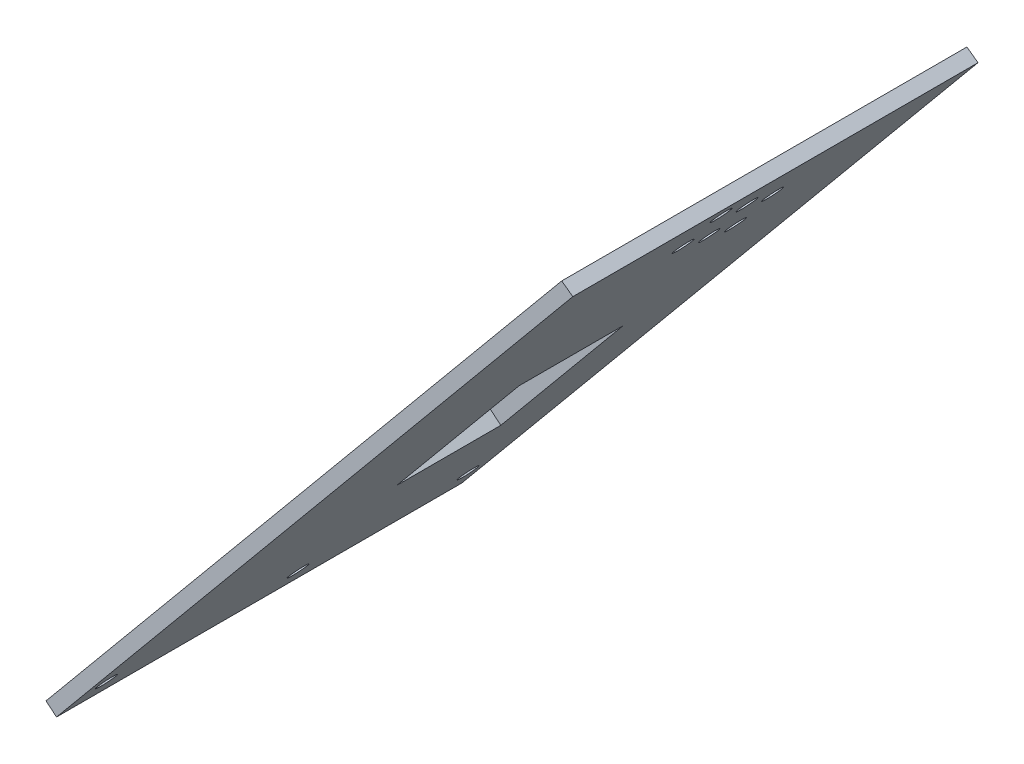
ISO-10303-21;
HEADER;
FILE_DESCRIPTION(('STEP AP214'),'2;1');
FILE_NAME('part.step','',(''),(''),'','','');
FILE_SCHEMA(('AUTOMOTIVE_DESIGN { 1 0 10303 214 1 1 1 1 }'));
ENDSEC;
DATA;
#1=APPLICATION_CONTEXT('core data for automotive mechanical design processes');
#2=APPLICATION_PROTOCOL_DEFINITION('international standard','automotive_design',2000,#1);
#3=PRODUCT_CONTEXT('',#1,'mechanical');
#4=PRODUCT('Part','Part','',(#3));
#5=PRODUCT_RELATED_PRODUCT_CATEGORY('part','',(#4));
#6=PRODUCT_DEFINITION_FORMATION('','',#4);
#7=PRODUCT_DEFINITION_CONTEXT('part definition',#1,'design');
#8=PRODUCT_DEFINITION('design','',#6,#7);
#9=PRODUCT_DEFINITION_SHAPE('','',#8);
#10=(LENGTH_UNIT() NAMED_UNIT(*) SI_UNIT(.MILLI.,.METRE.));
#11=(NAMED_UNIT(*) PLANE_ANGLE_UNIT() SI_UNIT($,.RADIAN.));
#12=(NAMED_UNIT(*) SI_UNIT($,.STERADIAN.) SOLID_ANGLE_UNIT());
#13=UNCERTAINTY_MEASURE_WITH_UNIT(LENGTH_MEASURE(1.E-05),#10,'distance_accuracy_value','');
#14=(GEOMETRIC_REPRESENTATION_CONTEXT(3) GLOBAL_UNCERTAINTY_ASSIGNED_CONTEXT((#13)) GLOBAL_UNIT_ASSIGNED_CONTEXT((#10,
#11,#12)) REPRESENTATION_CONTEXT('',''));
#15=CARTESIAN_POINT('',(0.,0.,0.));
#16=DIRECTION('',(0.,0.,1.));
#17=DIRECTION('',(1.,0.,0.));
#18=AXIS2_PLACEMENT_3D('',#15,#16,#17);
#19=CARTESIAN_POINT('',(1.92394482496182,-1.59638225701197,-37.));
#20=DIRECTION('',(0.76957792998473,-0.638552902804786,0.));
#21=DIRECTION('',(0.638552902804786,0.76957792998473,0.));
#22=AXIS2_PLACEMENT_3D('',#19,#20,#21);
#23=PLANE('',#22);
#24=CARTESIAN_POINT('',(5.43598579038817,2.63629635790407,33.0000000000001));
#25=DIRECTION('',(0.76957792998473,-0.638552902804786,0.));
#26=DIRECTION('',(0.638552902804786,0.76957792998473,0.));
#27=AXIS2_PLACEMENT_3D('',#24,#25,#26);
#28=CIRCLE('',#27,1.69999999999999);
#29=CARTESIAN_POINT('',(6.5215257251563,3.9445788388781,33.0000000000001));
#30=VERTEX_POINT('',#29);
#31=EDGE_CURVE('E197',#30,#30,#28,.T.);
#32=ORIENTED_EDGE('',*,*,#31,.F.);
#33=EDGE_LOOP('',(#32));
#34=FACE_BOUND('',#33,.T.);
#35=CARTESIAN_POINT('',(5.43598579038815,2.63629635790404,-32.9999999999999));
#36=DIRECTION('',(0.76957792998473,-0.638552902804786,0.));
#37=DIRECTION('',(0.638552902804786,0.76957792998473,0.));
#38=AXIS2_PLACEMENT_3D('',#35,#36,#37);
#39=CIRCLE('',#38,1.69999999999999);
#40=CARTESIAN_POINT('',(6.52152572515628,3.94457883887808,-32.9999999999999));
#41=VERTEX_POINT('',#40);
#42=EDGE_CURVE('E200',#41,#41,#39,.T.);
#43=ORIENTED_EDGE('',*,*,#42,.F.);
#44=EDGE_LOOP('',(#43));
#45=FACE_BOUND('',#44,.T.);
#46=CARTESIAN_POINT('',(5.43598579038817,2.63629635790407,-1.99999999999988));
#47=DIRECTION('',(0.76957792998473,-0.638552902804786,0.));
#48=DIRECTION('',(0.638552902804786,0.76957792998473,0.));
#49=AXIS2_PLACEMENT_3D('',#46,#47,#48);
#50=CIRCLE('',#49,1.7);
#51=CARTESIAN_POINT('',(6.5215257251563,3.9445788388781,-1.99999999999988));
#52=VERTEX_POINT('',#51);
#53=EDGE_CURVE('E203',#52,#52,#50,.T.);
#54=ORIENTED_EDGE('',*,*,#53,.F.);
#55=EDGE_LOOP('',(#54));
#56=FACE_BOUND('',#55,.T.);
#57=DIRECTION('',(0.638552902804786,0.76957792998473,0.));
#58=VECTOR('',#57,1.);
#59=CARTESIAN_POINT('',(1.92394482496182,-1.59638225701197,-17.));
#60=LINE('',#59,#58);
#61=CARTESIAN_POINT('',(27.4660609371533,29.1867349423772,-17.));
#62=VERTEX_POINT('',#61);
#63=CARTESIAN_POINT('',(49.8154125353208,56.1219624918428,-17.));
#64=VERTEX_POINT('',#63);
#65=EDGE_CURVE('E171',#62,#64,#60,.T.);
#66=ORIENTED_EDGE('',*,*,#65,.F.);
#67=DIRECTION('',(0.,0.,-1.));
#68=VECTOR('',#67,1.);
#69=CARTESIAN_POINT('',(27.4660609371533,29.1867349423772,-37.));
#70=LINE('',#69,#68);
#71=CARTESIAN_POINT('',(27.4660609371533,29.1867349423772,1.99999999999999));
#72=VERTEX_POINT('',#71);
#73=EDGE_CURVE('E177',#72,#62,#70,.T.);
#74=ORIENTED_EDGE('',*,*,#73,.F.);
#75=DIRECTION('',(-0.638552902804786,-0.76957792998473,0.));
#76=VECTOR('',#75,1.);
#77=CARTESIAN_POINT('',(1.92394482496182,-1.59638225701197,1.99999999999999));
#78=LINE('',#77,#76);
#79=CARTESIAN_POINT('',(49.8154125353208,56.1219624918428,1.99999999999999));
#80=VERTEX_POINT('',#79);
#81=EDGE_CURVE('E175',#80,#72,#78,.T.);
#82=ORIENTED_EDGE('',*,*,#81,.F.);
#83=DIRECTION('',(0.,0.,1.));
#84=VECTOR('',#83,1.);
#85=CARTESIAN_POINT('',(49.8154125353208,56.1219624918428,-37.));
#86=LINE('',#85,#84);
#87=EDGE_CURVE('E173',#64,#80,#86,.T.);
#88=ORIENTED_EDGE('',*,*,#87,.F.);
#89=EDGE_LOOP('',(#66,#74,#82,#88));
#90=FACE_BOUND('',#89,.T.);
#91=CARTESIAN_POINT('',(80.9949650068493,93.6992647693719,-1.5533866649602));
#92=DIRECTION('',(0.76957792998473,-0.638552902804786,0.));
#93=DIRECTION('',(0.638552902804786,0.76957792998473,0.));
#94=AXIS2_PLACEMENT_3D('',#91,#92,#93);
#95=CIRCLE('',#94,1.70000000000001);
#96=CARTESIAN_POINT('',(82.0805049416174,95.007547250346,-1.5533866649602));
#97=VERTEX_POINT('',#96);
#98=EDGE_CURVE('E163',#97,#97,#95,.T.);
#99=ORIENTED_EDGE('',*,*,#98,.F.);
#100=EDGE_LOOP('',(#99));
#101=FACE_BOUND('',#100,.T.);
#102=CARTESIAN_POINT('',(84.6494465443313,98.1036114169708,-9.4570049175146));
#103=DIRECTION('',(0.76957792998473,-0.638552902804786,0.));
#104=DIRECTION('',(0.638552902804786,0.76957792998473,0.));
#105=AXIS2_PLACEMENT_3D('',#102,#103,#104);
#106=CIRCLE('',#105,1.7);
#107=CARTESIAN_POINT('',(85.7349864790994,99.4118938979449,-9.4570049175146));
#108=VERTEX_POINT('',#107);
#109=EDGE_CURVE('E160',#108,#108,#106,.T.);
#110=ORIENTED_EDGE('',*,*,#109,.F.);
#111=EDGE_LOOP('',(#110));
#112=FACE_BOUND('',#111,.T.);
#113=CARTESIAN_POINT('',(87.9437084100887,102.073824716983,-1.45229617633338));
#114=DIRECTION('',(0.76957792998473,-0.638552902804786,0.));
#115=DIRECTION('',(0.638552902804786,0.76957792998473,0.));
#116=AXIS2_PLACEMENT_3D('',#113,#114,#115);
#117=CIRCLE('',#116,1.7);
#118=CARTESIAN_POINT('',(89.0292483448568,103.382107197957,-1.45229617633338));
#119=VERTEX_POINT('',#118);
#120=EDGE_CURVE('E157',#119,#119,#117,.T.);
#121=ORIENTED_EDGE('',*,*,#120,.F.);
#122=EDGE_LOOP('',(#121));
#123=FACE_BOUND('',#122,.T.);
#124=CARTESIAN_POINT('',(84.3308297053064,97.7196174105886,6.55241256484784));
#125=DIRECTION('',(0.76957792998473,-0.638552902804786,0.));
#126=DIRECTION('',(0.638552902804786,0.76957792998473,0.));
#127=AXIS2_PLACEMENT_3D('',#124,#125,#126);
#128=CIRCLE('',#127,1.7);
#129=CARTESIAN_POINT('',(85.4163696400746,99.0278998915626,6.55241256484784));
#130=VERTEX_POINT('',#129);
#131=EDGE_CURVE('E156',#130,#130,#128,.T.);
#132=ORIENTED_EDGE('',*,*,#131,.F.);
#133=EDGE_LOOP('',(#132));
#134=FACE_BOUND('',#133,.T.);
#135=CARTESIAN_POINT('',(77.6591003083921,89.6789121281552,-9.65918589476824));
#136=DIRECTION('',(0.76957792998473,-0.638552902804786,0.));
#137=DIRECTION('',(0.638552902804786,0.76957792998473,0.));
#138=AXIS2_PLACEMENT_3D('',#135,#136,#137);
#139=CIRCLE('',#138,1.70000000000001);
#140=CARTESIAN_POINT('',(78.7446402431603,90.9871946091293,-9.65918589476824));
#141=VERTEX_POINT('',#140);
#142=EDGE_CURVE('E166',#141,#141,#139,.T.);
#143=ORIENTED_EDGE('',*,*,#142,.F.);
#144=EDGE_LOOP('',(#143));
#145=FACE_BOUND('',#144,.T.);
#146=CARTESIAN_POINT('',(91.2379702822316,106.044038024692,6.55241256484785));
#147=DIRECTION('',(0.76957792998473,-0.638552902804786,0.));
#148=DIRECTION('',(0.638552902804786,0.76957792998473,0.));
#149=AXIS2_PLACEMENT_3D('',#146,#147,#148);
#150=CIRCLE('',#149,1.70000000000001);
#151=CARTESIAN_POINT('',(92.3235102169998,107.352320505666,6.55241256484785));
#152=VERTEX_POINT('',#151);
#153=EDGE_CURVE('E137',#152,#152,#150,.T.);
#154=ORIENTED_EDGE('',*,*,#153,.F.);
#155=EDGE_LOOP('',(#154));
#156=FACE_BOUND('',#155,.T.);
#157=DIRECTION('',(0.,0.,1.));
#158=VECTOR('',#157,1.);
#159=CARTESIAN_POINT('',(94.6138037577798,110.11256065872,-37.));
#160=LINE('',#159,#158);
#161=CARTESIAN_POINT('',(94.6138037577798,110.11256065872,-37.));
#162=VERTEX_POINT('',#161);
#163=CARTESIAN_POINT('',(94.6138037577798,110.11256065872,37.));
#164=VERTEX_POINT('',#163);
#165=EDGE_CURVE('E11',#162,#164,#160,.T.);
#166=ORIENTED_EDGE('',*,*,#165,.T.);
#167=DIRECTION('',(0.638552902804786,0.76957792998473,0.));
#168=VECTOR('',#167,1.);
#169=CARTESIAN_POINT('',(1.92394482496182,-1.59638225701197,37.));
#170=LINE('',#169,#168);
#171=CARTESIAN_POINT('',(0.327562567949858,-3.52032708197379,37.));
#172=VERTEX_POINT('',#171);
#173=EDGE_CURVE('E114',#172,#164,#170,.T.);
#174=ORIENTED_EDGE('',*,*,#173,.F.);
#175=DIRECTION('',(0.,0.,1.));
#176=VECTOR('',#175,1.);
#177=CARTESIAN_POINT('',(0.327562567949858,-3.52032708197379,-37.));
#178=LINE('',#177,#176);
#179=CARTESIAN_POINT('',(0.327562567949858,-3.52032708197379,-37.));
#180=VERTEX_POINT('',#179);
#181=EDGE_CURVE('E45',#180,#172,#178,.T.);
#182=ORIENTED_EDGE('',*,*,#181,.F.);
#183=DIRECTION('',(0.638552902804786,0.76957792998473,0.));
#184=VECTOR('',#183,1.);
#185=CARTESIAN_POINT('',(1.92394482496182,-1.59638225701197,-37.));
#186=LINE('',#185,#184);
#187=EDGE_CURVE('E116',#180,#162,#186,.T.);
#188=ORIENTED_EDGE('',*,*,#187,.T.);
#189=EDGE_LOOP('',(#166,#174,#182,#188));
#190=FACE_BOUND('',#189,.T.);
#191=ADVANCED_FACE('F36',(#34,#45,#56,#90,#101,#112,#123,#134,#145,#156,#190),#23,.T.);
#192=CARTESIAN_POINT('',(-16.2183629267218,10.2085603283291,-37.));
#193=DIRECTION('',(-0.638552902804786,-0.76957792998473,0.));
#194=DIRECTION('',(0.76957792998473,-0.638552902804786,0.));
#195=AXIS2_PLACEMENT_3D('',#192,#193,#194);
#196=PLANE('',#195);
#197=DIRECTION('',(0.,0.,1.));
#198=VECTOR('',#197,1.);
#199=CARTESIAN_POINT('',(-1.59638225701197,-1.92394482496182,-37.));
#200=LINE('',#199,#198);
#201=CARTESIAN_POINT('',(-1.59638225701196,-1.92394482496182,-37.));
#202=VERTEX_POINT('',#201);
#203=CARTESIAN_POINT('',(-1.59638225701196,-1.92394482496182,37.));
#204=VERTEX_POINT('',#203);
#205=EDGE_CURVE('E211',#202,#204,#200,.T.);
#206=ORIENTED_EDGE('',*,*,#205,.F.);
#207=DIRECTION('',(0.76957792998473,-0.638552902804786,0.));
#208=VECTOR('',#207,1.);
#209=CARTESIAN_POINT('',(-16.2183629267218,10.2085603283291,-37.));
#210=LINE('',#209,#208);
#211=EDGE_CURVE('E124',#202,#180,#210,.T.);
#212=ORIENTED_EDGE('',*,*,#211,.T.);
#213=ORIENTED_EDGE('',*,*,#181,.T.);
#214=DIRECTION('',(0.76957792998473,-0.638552902804786,0.));
#215=VECTOR('',#214,1.);
#216=CARTESIAN_POINT('',(-16.2183629267218,10.2085603283291,37.));
#217=LINE('',#216,#215);
#218=EDGE_CURVE('E119',#204,#172,#217,.T.);
#219=ORIENTED_EDGE('',*,*,#218,.F.);
#220=EDGE_LOOP('',(#206,#212,#213,#219));
#221=FACE_BOUND('',#220,.T.);
#222=ADVANCED_FACE('F222',(#221),#196,.T.);
#223=CARTESIAN_POINT('',(0.,0.,-37.));
#224=DIRECTION('',(0.76957792998473,-0.638552902804786,0.));
#225=DIRECTION('',(0.638552902804786,0.76957792998473,0.));
#226=AXIS2_PLACEMENT_3D('',#223,#224,#225);
#227=PLANE('',#226);
#228=CARTESIAN_POINT('',(3.51204096542634,4.23267861491604,33.0000000000001));
#229=DIRECTION('',(-0.76957792998473,0.638552902804786,0.));
#230=DIRECTION('',(-0.638552902804786,-0.76957792998473,0.));
#231=AXIS2_PLACEMENT_3D('',#228,#229,#230);
#232=CIRCLE('',#231,1.69999999999999);
#233=CARTESIAN_POINT('',(2.42650103065821,2.924396133942,33.0000000000001));
#234=VERTEX_POINT('',#233);
#235=EDGE_CURVE('E206',#234,#234,#232,.T.);
#236=ORIENTED_EDGE('',*,*,#235,.F.);
#237=EDGE_LOOP('',(#236));
#238=FACE_BOUND('',#237,.T.);
#239=CARTESIAN_POINT('',(3.51204096542632,4.23267861491601,-32.9999999999999));
#240=DIRECTION('',(-0.76957792998473,0.638552902804786,0.));
#241=DIRECTION('',(-0.638552902804786,-0.76957792998473,0.));
#242=AXIS2_PLACEMENT_3D('',#239,#240,#241);
#243=CIRCLE('',#242,1.69999999999999);
#244=CARTESIAN_POINT('',(2.42650103065819,2.92439613394198,-32.9999999999999));
#245=VERTEX_POINT('',#244);
#246=EDGE_CURVE('E210',#245,#245,#243,.T.);
#247=ORIENTED_EDGE('',*,*,#246,.F.);
#248=EDGE_LOOP('',(#247));
#249=FACE_BOUND('',#248,.T.);
#250=CARTESIAN_POINT('',(3.51204096542634,4.23267861491603,-1.99999999999988));
#251=DIRECTION('',(-0.76957792998473,0.638552902804786,0.));
#252=DIRECTION('',(-0.638552902804786,-0.76957792998473,0.));
#253=AXIS2_PLACEMENT_3D('',#250,#251,#252);
#254=CIRCLE('',#253,1.7);
#255=CARTESIAN_POINT('',(2.42650103065821,2.924396133942,-1.99999999999988));
#256=VERTEX_POINT('',#255);
#257=EDGE_CURVE('E207',#256,#256,#254,.T.);
#258=ORIENTED_EDGE('',*,*,#257,.F.);
#259=EDGE_LOOP('',(#258));
#260=FACE_BOUND('',#259,.T.);
#261=DIRECTION('',(0.,0.,1.));
#262=VECTOR('',#261,1.);
#263=CARTESIAN_POINT('',(25.5421161121915,30.7831171993892,-17.));
#264=LINE('',#263,#262);
#265=CARTESIAN_POINT('',(25.5421161121914,30.7831171993892,-17.));
#266=VERTEX_POINT('',#265);
#267=CARTESIAN_POINT('',(25.5421161121915,30.7831171993892,1.99999999999999));
#268=VERTEX_POINT('',#267);
#269=EDGE_CURVE('E193',#266,#268,#264,.T.);
#270=ORIENTED_EDGE('',*,*,#269,.F.);
#271=DIRECTION('',(-0.638552902804786,-0.769577929984729,0.));
#272=VECTOR('',#271,1.);
#273=CARTESIAN_POINT('',(25.5421161121915,30.7831171993892,-17.));
#274=LINE('',#273,#272);
#275=CARTESIAN_POINT('',(47.891467710359,57.7183447488547,-17.));
#276=VERTEX_POINT('',#275);
#277=EDGE_CURVE('E195',#276,#266,#274,.T.);
#278=ORIENTED_EDGE('',*,*,#277,.F.);
#279=DIRECTION('',(0.,0.,-1.));
#280=VECTOR('',#279,1.);
#281=CARTESIAN_POINT('',(47.891467710359,57.7183447488547,-17.));
#282=LINE('',#281,#280);
#283=CARTESIAN_POINT('',(47.891467710359,57.7183447488547,1.99999999999999));
#284=VERTEX_POINT('',#283);
#285=EDGE_CURVE('E183',#284,#276,#282,.T.);
#286=ORIENTED_EDGE('',*,*,#285,.F.);
#287=DIRECTION('',(0.638552902804786,0.769577929984729,0.));
#288=VECTOR('',#287,1.);
#289=CARTESIAN_POINT('',(25.5421161121915,30.7831171993892,1.99999999999999));
#290=LINE('',#289,#288);
#291=EDGE_CURVE('E190',#268,#284,#290,.T.);
#292=ORIENTED_EDGE('',*,*,#291,.F.);
#293=EDGE_LOOP('',(#270,#278,#286,#292));
#294=FACE_BOUND('',#293,.T.);
#295=CARTESIAN_POINT('',(79.0710201818875,95.2956470263839,-1.5533866649602));
#296=DIRECTION('',(0.76957792998473,-0.638552902804786,0.));
#297=DIRECTION('',(0.638552902804786,0.76957792998473,0.));
#298=AXIS2_PLACEMENT_3D('',#295,#296,#297);
#299=CIRCLE('',#298,1.70000000000001);
#300=CARTESIAN_POINT('',(80.1565601166556,96.6039295073579,-1.5533866649602));
#301=VERTEX_POINT('',#300);
#302=EDGE_CURVE('E40',#301,#301,#299,.T.);
#303=ORIENTED_EDGE('',*,*,#302,.T.);
#304=EDGE_LOOP('',(#303));
#305=FACE_BOUND('',#304,.T.);
#306=CARTESIAN_POINT('',(82.7255017193695,99.6999936739828,-9.4570049175146));
#307=DIRECTION('',(0.76957792998473,-0.638552902804786,0.));
#308=DIRECTION('',(0.638552902804786,0.76957792998473,0.));
#309=AXIS2_PLACEMENT_3D('',#306,#307,#308);
#310=CIRCLE('',#309,1.7);
#311=CARTESIAN_POINT('',(83.8110416541376,101.008276154957,-9.4570049175146));
#312=VERTEX_POINT('',#311);
#313=EDGE_CURVE('E145',#312,#312,#310,.T.);
#314=ORIENTED_EDGE('',*,*,#313,.T.);
#315=EDGE_LOOP('',(#314));
#316=FACE_BOUND('',#315,.T.);
#317=CARTESIAN_POINT('',(86.0197635851269,103.670206973995,-1.45229617633338));
#318=DIRECTION('',(0.76957792998473,-0.638552902804786,0.));
#319=DIRECTION('',(0.638552902804786,0.76957792998473,0.));
#320=AXIS2_PLACEMENT_3D('',#317,#318,#319);
#321=CIRCLE('',#320,1.7);
#322=CARTESIAN_POINT('',(87.105303519895,104.978489454969,-1.45229617633338));
#323=VERTEX_POINT('',#322);
#324=EDGE_CURVE('E143',#323,#323,#321,.T.);
#325=ORIENTED_EDGE('',*,*,#324,.T.);
#326=EDGE_LOOP('',(#325));
#327=FACE_BOUND('',#326,.T.);
#328=CARTESIAN_POINT('',(82.4068848803446,99.3159996676006,6.55241256484784));
#329=DIRECTION('',(0.76957792998473,-0.638552902804786,0.));
#330=DIRECTION('',(0.638552902804786,0.76957792998473,0.));
#331=AXIS2_PLACEMENT_3D('',#328,#329,#330);
#332=CIRCLE('',#331,1.7);
#333=CARTESIAN_POINT('',(83.4924248151127,100.624282148575,6.55241256484784));
#334=VERTEX_POINT('',#333);
#335=EDGE_CURVE('E140',#334,#334,#332,.T.);
#336=ORIENTED_EDGE('',*,*,#335,.T.);
#337=EDGE_LOOP('',(#336));
#338=FACE_BOUND('',#337,.T.);
#339=CARTESIAN_POINT('',(75.7351554834303,91.2752943851672,-9.65918589476824));
#340=DIRECTION('',(0.76957792998473,-0.638552902804786,0.));
#341=DIRECTION('',(0.638552902804786,0.76957792998473,0.));
#342=AXIS2_PLACEMENT_3D('',#339,#340,#341);
#343=CIRCLE('',#342,1.70000000000001);
#344=CARTESIAN_POINT('',(76.8206954181984,92.5835768661413,-9.65918589476824));
#345=VERTEX_POINT('',#344);
#346=EDGE_CURVE('E136',#345,#345,#343,.T.);
#347=ORIENTED_EDGE('',*,*,#346,.T.);
#348=EDGE_LOOP('',(#347));
#349=FACE_BOUND('',#348,.T.);
#350=CARTESIAN_POINT('',(89.3140254572698,107.640420281704,6.55241256484785));
#351=DIRECTION('',(0.76957792998473,-0.638552902804786,0.));
#352=DIRECTION('',(0.638552902804786,0.76957792998473,0.));
#353=AXIS2_PLACEMENT_3D('',#350,#351,#352);
#354=CIRCLE('',#353,1.70000000000001);
#355=CARTESIAN_POINT('',(90.3995653920379,108.948702762678,6.55241256484785));
#356=VERTEX_POINT('',#355);
#357=EDGE_CURVE('E133',#356,#356,#354,.T.);
#358=ORIENTED_EDGE('',*,*,#357,.T.);
#359=EDGE_LOOP('',(#358));
#360=FACE_BOUND('',#359,.T.);
#361=DIRECTION('',(0.638552902804786,0.76957792998473,0.));
#362=VECTOR('',#361,1.);
#363=CARTESIAN_POINT('',(0.,0.,-37.));
#364=LINE('',#363,#362);
#365=CARTESIAN_POINT('',(92.590170906694,111.588799847786,-37.));
#366=VERTEX_POINT('',#365);
#367=EDGE_CURVE('E121',#202,#366,#364,.T.);
#368=ORIENTED_EDGE('',*,*,#367,.F.);
#369=ORIENTED_EDGE('',*,*,#205,.T.);
#370=DIRECTION('',(0.638552902804786,0.76957792998473,0.));
#371=VECTOR('',#370,1.);
#372=CARTESIAN_POINT('',(0.,0.,37.));
#373=LINE('',#372,#371);
#374=CARTESIAN_POINT('',(92.590170906694,111.588799847786,37.));
#375=VERTEX_POINT('',#374);
#376=EDGE_CURVE('E53',#204,#375,#373,.T.);
#377=ORIENTED_EDGE('',*,*,#376,.T.);
#378=DIRECTION('',(0.,0.,1.));
#379=VECTOR('',#378,1.);
#380=CARTESIAN_POINT('',(92.590170906694,111.588799847786,-37.));
#381=LINE('',#380,#379);
#382=EDGE_CURVE('E106',#366,#375,#381,.T.);
#383=ORIENTED_EDGE('',*,*,#382,.F.);
#384=EDGE_LOOP('',(#368,#369,#377,#383));
#385=FACE_BOUND('',#384,.T.);
#386=ADVANCED_FACE('F38',(#238,#249,#260,#294,#305,#316,#327,#338,#349,#360,#385),#227,.F.);
#387=CARTESIAN_POINT('',(116.785428362884,96.0577713406346,-37.));
#388=DIRECTION('',(0.,0.,1.));
#389=DIRECTION('',(1.,0.,0.));
#390=AXIS2_PLACEMENT_3D('',#387,#388,#389);
#391=PLANE('',#390);
#392=ORIENTED_EDGE('',*,*,#211,.F.);
#393=ORIENTED_EDGE('',*,*,#367,.T.);
#394=DIRECTION('',(0.807879498093236,-0.589347704297405,0.));
#395=VECTOR('',#394,1.);
#396=CARTESIAN_POINT('',(94.6138037577798,110.11256065872,-37.));
#397=LINE('',#396,#395);
#398=EDGE_CURVE('E108',#366,#162,#397,.T.);
#399=ORIENTED_EDGE('',*,*,#398,.T.);
#400=ORIENTED_EDGE('',*,*,#187,.F.);
#401=EDGE_LOOP('',(#392,#393,#399,#400));
#402=FACE_BOUND('',#401,.T.);
#403=ADVANCED_FACE('F219',(#402),#391,.F.);
#404=CARTESIAN_POINT('',(116.785428362884,96.0577713406346,37.));
#405=DIRECTION('',(0.,0.,1.));
#406=DIRECTION('',(1.,0.,0.));
#407=AXIS2_PLACEMENT_3D('',#404,#405,#406);
#408=PLANE('',#407);
#409=ORIENTED_EDGE('',*,*,#376,.F.);
#410=ORIENTED_EDGE('',*,*,#218,.T.);
#411=ORIENTED_EDGE('',*,*,#173,.T.);
#412=DIRECTION('',(0.807879498093236,-0.589347704297405,0.));
#413=VECTOR('',#412,1.);
#414=CARTESIAN_POINT('',(94.6138037577798,110.11256065872,37.));
#415=LINE('',#414,#413);
#416=EDGE_CURVE('E102',#375,#164,#415,.T.);
#417=ORIENTED_EDGE('',*,*,#416,.F.);
#418=EDGE_LOOP('',(#409,#410,#411,#417));
#419=FACE_BOUND('',#418,.T.);
#420=ADVANCED_FACE('F117',(#419),#408,.T.);
#421=CARTESIAN_POINT('',(73.5376778925828,120.730754789202,6.55241256484785));
#422=DIRECTION('',(0.769577929984729,-0.638552902804786,0.));
#423=DIRECTION('',(0.638552902804786,0.76957792998473,0.));
#424=AXIS2_PLACEMENT_3D('',#421,#422,#423);
#425=CYLINDRICAL_SURFACE('',#424,1.70000000000001);
#426=ORIENTED_EDGE('',*,*,#153,.T.);
#427=EDGE_LOOP('',(#426));
#428=FACE_BOUND('',#427,.T.);
#429=ORIENTED_EDGE('',*,*,#357,.F.);
#430=EDGE_LOOP('',(#429));
#431=FACE_BOUND('',#430,.T.);
#432=ADVANCED_FACE('F242',(#428,#431),#425,.F.);
#433=CARTESIAN_POINT('',(59.9588079187434,104.365628892665,-9.65918589476824));
#434=DIRECTION('',(0.769577929984729,-0.638552902804786,0.));
#435=DIRECTION('',(0.638552902804786,0.76957792998473,0.));
#436=AXIS2_PLACEMENT_3D('',#433,#434,#435);
#437=CYLINDRICAL_SURFACE('',#436,1.70000000000001);
#438=ORIENTED_EDGE('',*,*,#142,.T.);
#439=EDGE_LOOP('',(#438));
#440=FACE_BOUND('',#439,.T.);
#441=ORIENTED_EDGE('',*,*,#346,.F.);
#442=EDGE_LOOP('',(#441));
#443=FACE_BOUND('',#442,.T.);
#444=ADVANCED_FACE('F245',(#440,#443),#437,.F.);
#445=CARTESIAN_POINT('',(66.6305373156577,112.406334175099,6.55241256484784));
#446=DIRECTION('',(0.769577929984729,-0.638552902804786,0.));
#447=DIRECTION('',(0.638552902804786,0.76957792998473,0.));
#448=AXIS2_PLACEMENT_3D('',#445,#446,#447);
#449=CYLINDRICAL_SURFACE('',#448,1.7);
#450=ORIENTED_EDGE('',*,*,#131,.T.);
#451=EDGE_LOOP('',(#450));
#452=FACE_BOUND('',#451,.T.);
#453=ORIENTED_EDGE('',*,*,#335,.F.);
#454=EDGE_LOOP('',(#453));
#455=FACE_BOUND('',#454,.T.);
#456=ADVANCED_FACE('F251',(#452,#455),#449,.F.);
#457=CARTESIAN_POINT('',(70.2434160204399,116.760541481494,-1.45229617633338));
#458=DIRECTION('',(0.769577929984729,-0.638552902804786,0.));
#459=DIRECTION('',(0.638552902804786,0.76957792998473,0.));
#460=AXIS2_PLACEMENT_3D('',#457,#458,#459);
#461=CYLINDRICAL_SURFACE('',#460,1.7);
#462=ORIENTED_EDGE('',*,*,#120,.T.);
#463=EDGE_LOOP('',(#462));
#464=FACE_BOUND('',#463,.T.);
#465=ORIENTED_EDGE('',*,*,#324,.F.);
#466=EDGE_LOOP('',(#465));
#467=FACE_BOUND('',#466,.T.);
#468=ADVANCED_FACE('F247',(#464,#467),#461,.F.);
#469=CARTESIAN_POINT('',(66.9491541546825,112.790328181481,-9.4570049175146));
#470=DIRECTION('',(0.769577929984729,-0.638552902804786,0.));
#471=DIRECTION('',(0.638552902804786,0.76957792998473,0.));
#472=AXIS2_PLACEMENT_3D('',#469,#470,#471);
#473=CYLINDRICAL_SURFACE('',#472,1.7);
#474=ORIENTED_EDGE('',*,*,#109,.T.);
#475=EDGE_LOOP('',(#474));
#476=FACE_BOUND('',#475,.T.);
#477=ORIENTED_EDGE('',*,*,#313,.F.);
#478=EDGE_LOOP('',(#477));
#479=FACE_BOUND('',#478,.T.);
#480=ADVANCED_FACE('F250',(#476,#479),#473,.F.);
#481=CARTESIAN_POINT('',(63.2946726172005,108.385981533882,-1.5533866649602));
#482=DIRECTION('',(0.769577929984729,-0.638552902804786,0.));
#483=DIRECTION('',(0.638552902804786,0.76957792998473,0.));
#484=AXIS2_PLACEMENT_3D('',#481,#482,#483);
#485=CYLINDRICAL_SURFACE('',#484,1.70000000000001);
#486=ORIENTED_EDGE('',*,*,#98,.T.);
#487=EDGE_LOOP('',(#486));
#488=FACE_BOUND('',#487,.T.);
#489=ORIENTED_EDGE('',*,*,#302,.F.);
#490=EDGE_LOOP('',(#489));
#491=FACE_BOUND('',#490,.T.);
#492=ADVANCED_FACE('F256',(#488,#491),#485,.F.);
#493=CARTESIAN_POINT('',(32.468317482054,25.0361410741461,-17.));
#494=DIRECTION('',(0.,0.,-1.));
#495=DIRECTION('',(-1.,0.,0.));
#496=AXIS2_PLACEMENT_3D('',#493,#494,#495);
#497=PLANE('',#496);
#498=ORIENTED_EDGE('',*,*,#65,.T.);
#499=DIRECTION('',(-0.76957792998473,0.638552902804786,0.));
#500=VECTOR('',#499,1.);
#501=CARTESIAN_POINT('',(54.8176690802215,51.9713686236116,-17.));
#502=LINE('',#501,#500);
#503=EDGE_CURVE('E179',#64,#276,#502,.T.);
#504=ORIENTED_EDGE('',*,*,#503,.T.);
#505=ORIENTED_EDGE('',*,*,#277,.T.);
#506=DIRECTION('',(-0.76957792998473,0.638552902804786,0.));
#507=VECTOR('',#506,1.);
#508=CARTESIAN_POINT('',(32.468317482054,25.0361410741461,-17.));
#509=LINE('',#508,#507);
#510=EDGE_CURVE('E180',#62,#266,#509,.T.);
#511=ORIENTED_EDGE('',*,*,#510,.F.);
#512=EDGE_LOOP('',(#498,#504,#505,#511));
#513=FACE_BOUND('',#512,.T.);
#514=ADVANCED_FACE('F259',(#513),#497,.F.);
#515=CARTESIAN_POINT('',(54.8176690802215,51.9713686236116,-17.));
#516=DIRECTION('',(0.638552902804786,0.76957792998473,0.));
#517=DIRECTION('',(-0.76957792998473,0.638552902804786,0.));
#518=AXIS2_PLACEMENT_3D('',#515,#516,#517);
#519=PLANE('',#518);
#520=ORIENTED_EDGE('',*,*,#87,.T.);
#521=DIRECTION('',(-0.76957792998473,0.638552902804786,0.));
#522=VECTOR('',#521,1.);
#523=CARTESIAN_POINT('',(54.8176690802215,51.9713686236116,1.99999999999999));
#524=LINE('',#523,#522);
#525=EDGE_CURVE('E185',#80,#284,#524,.T.);
#526=ORIENTED_EDGE('',*,*,#525,.T.);
#527=ORIENTED_EDGE('',*,*,#285,.T.);
#528=ORIENTED_EDGE('',*,*,#503,.F.);
#529=EDGE_LOOP('',(#520,#526,#527,#528));
#530=FACE_BOUND('',#529,.T.);
#531=ADVANCED_FACE('F269',(#530),#519,.F.);
#532=CARTESIAN_POINT('',(32.468317482054,25.0361410741461,1.99999999999999));
#533=DIRECTION('',(0.,0.,1.));
#534=DIRECTION('',(1.,0.,0.));
#535=AXIS2_PLACEMENT_3D('',#532,#533,#534);
#536=PLANE('',#535);
#537=ORIENTED_EDGE('',*,*,#81,.T.);
#538=DIRECTION('',(-0.76957792998473,0.638552902804786,0.));
#539=VECTOR('',#538,1.);
#540=CARTESIAN_POINT('',(32.468317482054,25.0361410741461,1.99999999999999));
#541=LINE('',#540,#539);
#542=EDGE_CURVE('E61',#72,#268,#541,.T.);
#543=ORIENTED_EDGE('',*,*,#542,.T.);
#544=ORIENTED_EDGE('',*,*,#291,.T.);
#545=ORIENTED_EDGE('',*,*,#525,.F.);
#546=EDGE_LOOP('',(#537,#543,#544,#545));
#547=FACE_BOUND('',#546,.T.);
#548=ADVANCED_FACE('F275',(#547),#536,.F.);
#549=CARTESIAN_POINT('',(32.468317482054,25.0361410741461,-17.));
#550=DIRECTION('',(-0.638552902804786,-0.76957792998473,0.));
#551=DIRECTION('',(0.76957792998473,-0.638552902804786,0.));
#552=AXIS2_PLACEMENT_3D('',#549,#550,#551);
#553=PLANE('',#552);
#554=ORIENTED_EDGE('',*,*,#73,.T.);
#555=ORIENTED_EDGE('',*,*,#510,.T.);
#556=ORIENTED_EDGE('',*,*,#269,.T.);
#557=ORIENTED_EDGE('',*,*,#542,.F.);
#558=EDGE_LOOP('',(#554,#555,#556,#557));
#559=FACE_BOUND('',#558,.T.);
#560=ADVANCED_FACE('F271',(#559),#553,.F.);
#561=CARTESIAN_POINT('',(10.4382423352889,-1.51429751032704,-1.99999999999988));
#562=DIRECTION('',(-0.76957792998473,0.638552902804786,0.));
#563=DIRECTION('',(-0.638552902804786,-0.76957792998473,0.));
#564=AXIS2_PLACEMENT_3D('',#561,#562,#563);
#565=CYLINDRICAL_SURFACE('',#564,1.7);
#566=ORIENTED_EDGE('',*,*,#53,.T.);
#567=EDGE_LOOP('',(#566));
#568=FACE_BOUND('',#567,.T.);
#569=ORIENTED_EDGE('',*,*,#257,.T.);
#570=EDGE_LOOP('',(#569));
#571=FACE_BOUND('',#570,.T.);
#572=ADVANCED_FACE('F274',(#568,#571),#565,.F.);
#573=CARTESIAN_POINT('',(10.4382423352889,-1.51429751032706,-32.9999999999999));
#574=DIRECTION('',(-0.76957792998473,0.638552902804786,0.));
#575=DIRECTION('',(-0.638552902804786,-0.76957792998473,0.));
#576=AXIS2_PLACEMENT_3D('',#573,#574,#575);
#577=CYLINDRICAL_SURFACE('',#576,1.69999999999999);
#578=ORIENTED_EDGE('',*,*,#42,.T.);
#579=EDGE_LOOP('',(#578));
#580=FACE_BOUND('',#579,.T.);
#581=ORIENTED_EDGE('',*,*,#246,.T.);
#582=EDGE_LOOP('',(#581));
#583=FACE_BOUND('',#582,.T.);
#584=ADVANCED_FACE('F284',(#580,#583),#577,.F.);
#585=CARTESIAN_POINT('',(10.4382423352889,-1.51429751032704,33.0000000000001));
#586=DIRECTION('',(-0.76957792998473,0.638552902804786,0.));
#587=DIRECTION('',(-0.638552902804786,-0.76957792998473,0.));
#588=AXIS2_PLACEMENT_3D('',#585,#586,#587);
#589=CYLINDRICAL_SURFACE('',#588,1.69999999999999);
#590=ORIENTED_EDGE('',*,*,#31,.T.);
#591=EDGE_LOOP('',(#590));
#592=FACE_BOUND('',#591,.T.);
#593=ORIENTED_EDGE('',*,*,#235,.T.);
#594=EDGE_LOOP('',(#593));
#595=FACE_BOUND('',#594,.T.);
#596=ADVANCED_FACE('F288',(#592,#595),#589,.F.);
#597=CARTESIAN_POINT('',(94.6138037577798,110.11256065872,-37.));
#598=DIRECTION('',(-0.589347704297405,-0.807879498093236,0.));
#599=DIRECTION('',(0.807879498093236,-0.589347704297405,0.));
#600=AXIS2_PLACEMENT_3D('',#597,#598,#599);
#601=PLANE('',#600);
#602=ORIENTED_EDGE('',*,*,#165,.F.);
#603=ORIENTED_EDGE('',*,*,#398,.F.);
#604=ORIENTED_EDGE('',*,*,#382,.T.);
#605=ORIENTED_EDGE('',*,*,#416,.T.);
#606=EDGE_LOOP('',(#602,#603,#604,#605));
#607=FACE_BOUND('',#606,.T.);
#608=ADVANCED_FACE('F103',(#607),#601,.F.);
#609=CLOSED_SHELL('',(#191,#222,#386,#403,#420,#432,#444,#456,#468,#480,#492,#514,#531,#548,
#560,#572,#584,#596,#608));
#610=MANIFOLD_SOLID_BREP('B2',#609);
#611=ADVANCED_BREP_SHAPE_REPRESENTATION('',(#18,#610),#14);
#612=SHAPE_DEFINITION_REPRESENTATION(#9,#611);
ENDSEC;
END-ISO-10303-21;
